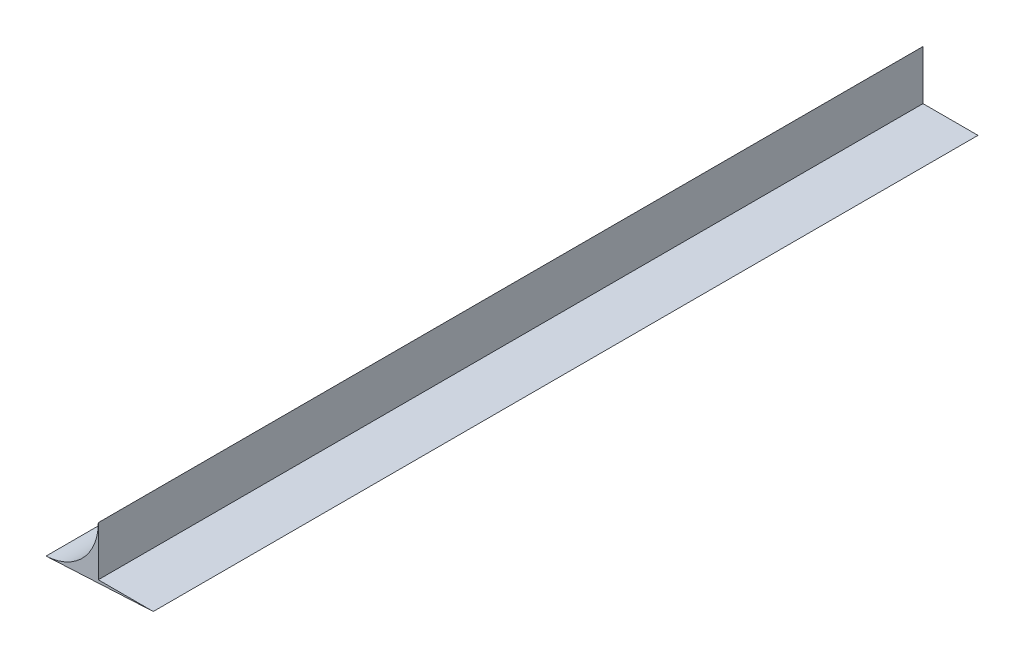
ISO-10303-21;
HEADER;
FILE_DESCRIPTION(('STEP AP214'),'2;1');
FILE_NAME('part.step','',(''),(''),'','','');
FILE_SCHEMA(('AUTOMOTIVE_DESIGN { 1 0 10303 214 1 1 1 1 }'));
ENDSEC;
DATA;
#1=APPLICATION_CONTEXT('core data for automotive mechanical design processes');
#2=APPLICATION_PROTOCOL_DEFINITION('international standard','automotive_design',2000,#1);
#3=PRODUCT_CONTEXT('',#1,'mechanical');
#4=PRODUCT('Part','Part','',(#3));
#5=PRODUCT_RELATED_PRODUCT_CATEGORY('part','',(#4));
#6=PRODUCT_DEFINITION_FORMATION('','',#4);
#7=PRODUCT_DEFINITION_CONTEXT('part definition',#1,'design');
#8=PRODUCT_DEFINITION('design','',#6,#7);
#9=PRODUCT_DEFINITION_SHAPE('','',#8);
#10=(LENGTH_UNIT() NAMED_UNIT(*) SI_UNIT(.MILLI.,.METRE.));
#11=(NAMED_UNIT(*) PLANE_ANGLE_UNIT() SI_UNIT($,.RADIAN.));
#12=(NAMED_UNIT(*) SI_UNIT($,.STERADIAN.) SOLID_ANGLE_UNIT());
#13=UNCERTAINTY_MEASURE_WITH_UNIT(LENGTH_MEASURE(1.E-05),#10,'distance_accuracy_value','');
#14=(GEOMETRIC_REPRESENTATION_CONTEXT(3) GLOBAL_UNCERTAINTY_ASSIGNED_CONTEXT((#13)) GLOBAL_UNIT_ASSIGNED_CONTEXT((#10,
#11,#12)) REPRESENTATION_CONTEXT('',''));
#15=CARTESIAN_POINT('',(0.,0.,0.));
#16=DIRECTION('',(0.,0.,1.));
#17=DIRECTION('',(1.,0.,0.));
#18=AXIS2_PLACEMENT_3D('',#15,#16,#17);
#19=CARTESIAN_POINT('',(-15.0544258345715,13.5,225.));
#20=DIRECTION('',(0.,0.,-1.));
#21=DIRECTION('',(-1.,0.,0.));
#22=AXIS2_PLACEMENT_3D('',#19,#20,#21);
#23=CYLINDRICAL_SURFACE('',#22,15.0544258345715);
#24=CARTESIAN_POINT('',(-15.0544258345715,13.5,0.));
#25=DIRECTION('',(0.,0.,-1.));
#26=DIRECTION('',(1.,0.,0.));
#27=AXIS2_PLACEMENT_3D('',#24,#25,#26);
#28=CIRCLE('',#27,15.0544258345715);
#29=CARTESIAN_POINT('',(0.,13.5,0.));
#30=VERTEX_POINT('',#29);
#31=CARTESIAN_POINT('',(-14.2665380628308,-1.53379426717536,0.));
#32=VERTEX_POINT('',#31);
#33=EDGE_CURVE('E107',#30,#32,#28,.T.);
#34=ORIENTED_EDGE('',*,*,#33,.T.);
#35=DIRECTION('',(0.,0.,-1.));
#36=VECTOR('',#35,1.);
#37=CARTESIAN_POINT('',(-14.2665380628308,-1.53379426717536,225.));
#38=LINE('',#37,#36);
#39=CARTESIAN_POINT('',(-14.2665380628308,-1.53379426717536,225.));
#40=VERTEX_POINT('',#39);
#41=EDGE_CURVE('E11',#40,#32,#38,.T.);
#42=ORIENTED_EDGE('',*,*,#41,.F.);
#43=CARTESIAN_POINT('',(-15.0544258345715,13.5,225.));
#44=DIRECTION('',(0.,0.,-1.));
#45=DIRECTION('',(1.,0.,0.));
#46=AXIS2_PLACEMENT_3D('',#43,#44,#45);
#47=CIRCLE('',#46,15.0544258345715);
#48=CARTESIAN_POINT('',(0.,13.5,225.));
#49=VERTEX_POINT('',#48);
#50=EDGE_CURVE('E91',#49,#40,#47,.T.);
#51=ORIENTED_EDGE('',*,*,#50,.F.);
#52=DIRECTION('',(0.,0.,-1.));
#53=VECTOR('',#52,1.);
#54=CARTESIAN_POINT('',(0.,13.5,225.));
#55=LINE('',#54,#53);
#56=EDGE_CURVE('E103',#49,#30,#55,.T.);
#57=ORIENTED_EDGE('',*,*,#56,.T.);
#58=EDGE_LOOP('',(#34,#42,#51,#57));
#59=FACE_BOUND('',#58,.T.);
#60=ADVANCED_FACE('F39',(#59),#23,.F.);
#61=CARTESIAN_POINT('',(15.,0.,225.));
#62=DIRECTION('',(-0.0523359562429371,0.998629534754574,0.));
#63=DIRECTION('',(-0.998629534754574,-0.0523359562429371,0.));
#64=AXIS2_PLACEMENT_3D('',#61,#62,#63);
#65=PLANE('',#64);
#66=DIRECTION('',(0.998629534754574,0.0523359562429371,0.));
#67=VECTOR('',#66,1.);
#68=CARTESIAN_POINT('',(15.,0.,0.));
#69=LINE('',#68,#67);
#70=CARTESIAN_POINT('',(15.,0.,0.));
#71=VERTEX_POINT('',#70);
#72=EDGE_CURVE('E96',#32,#71,#69,.T.);
#73=ORIENTED_EDGE('',*,*,#72,.T.);
#74=DIRECTION('',(0.,0.,-1.));
#75=VECTOR('',#74,1.);
#76=CARTESIAN_POINT('',(15.,0.,225.));
#77=LINE('',#76,#75);
#78=CARTESIAN_POINT('',(15.,0.,225.));
#79=VERTEX_POINT('',#78);
#80=EDGE_CURVE('E48',#79,#71,#77,.T.);
#81=ORIENTED_EDGE('',*,*,#80,.F.);
#82=DIRECTION('',(0.998629534754574,0.0523359562429371,0.));
#83=VECTOR('',#82,1.);
#84=CARTESIAN_POINT('',(15.,0.,225.));
#85=LINE('',#84,#83);
#86=EDGE_CURVE('E86',#40,#79,#85,.T.);
#87=ORIENTED_EDGE('',*,*,#86,.F.);
#88=ORIENTED_EDGE('',*,*,#41,.T.);
#89=EDGE_LOOP('',(#73,#81,#87,#88));
#90=FACE_BOUND('',#89,.T.);
#91=ADVANCED_FACE('F95',(#90),#65,.F.);
#92=CARTESIAN_POINT('',(0.,0.,225.));
#93=DIRECTION('',(0.,-1.,0.));
#94=DIRECTION('',(0.,0.,-1.));
#95=AXIS2_PLACEMENT_3D('',#92,#93,#94);
#96=PLANE('',#95);
#97=DIRECTION('',(-1.,0.,0.));
#98=VECTOR('',#97,1.);
#99=CARTESIAN_POINT('',(0.,0.,0.));
#100=LINE('',#99,#98);
#101=CARTESIAN_POINT('',(0.,0.,0.));
#102=VERTEX_POINT('',#101);
#103=EDGE_CURVE('E73',#71,#102,#100,.T.);
#104=ORIENTED_EDGE('',*,*,#103,.T.);
#105=DIRECTION('',(0.,0.,-1.));
#106=VECTOR('',#105,1.);
#107=CARTESIAN_POINT('',(0.,0.,225.));
#108=LINE('',#107,#106);
#109=CARTESIAN_POINT('',(0.,0.,225.));
#110=VERTEX_POINT('',#109);
#111=EDGE_CURVE('E98',#110,#102,#108,.T.);
#112=ORIENTED_EDGE('',*,*,#111,.F.);
#113=DIRECTION('',(-1.,0.,0.));
#114=VECTOR('',#113,1.);
#115=CARTESIAN_POINT('',(0.,0.,225.));
#116=LINE('',#115,#114);
#117=EDGE_CURVE('E89',#79,#110,#116,.T.);
#118=ORIENTED_EDGE('',*,*,#117,.F.);
#119=ORIENTED_EDGE('',*,*,#80,.T.);
#120=EDGE_LOOP('',(#104,#112,#118,#119));
#121=FACE_BOUND('',#120,.T.);
#122=ADVANCED_FACE('F99',(#121),#96,.F.);
#123=CARTESIAN_POINT('',(0.,0.,225.));
#124=DIRECTION('',(-1.,0.,0.));
#125=DIRECTION('',(0.,0.,1.));
#126=AXIS2_PLACEMENT_3D('',#123,#124,#125);
#127=PLANE('',#126);
#128=DIRECTION('',(0.,1.,0.));
#129=VECTOR('',#128,1.);
#130=CARTESIAN_POINT('',(0.,0.,0.));
#131=LINE('',#130,#129);
#132=EDGE_CURVE('E79',#102,#30,#131,.T.);
#133=ORIENTED_EDGE('',*,*,#132,.T.);
#134=ORIENTED_EDGE('',*,*,#56,.F.);
#135=DIRECTION('',(0.,1.,0.));
#136=VECTOR('',#135,1.);
#137=CARTESIAN_POINT('',(0.,0.,225.));
#138=LINE('',#137,#136);
#139=EDGE_CURVE('E56',#110,#49,#138,.T.);
#140=ORIENTED_EDGE('',*,*,#139,.F.);
#141=ORIENTED_EDGE('',*,*,#111,.T.);
#142=EDGE_LOOP('',(#133,#134,#140,#141));
#143=FACE_BOUND('',#142,.T.);
#144=ADVANCED_FACE('F120',(#143),#127,.F.);
#145=CARTESIAN_POINT('',(-15.0544258345715,13.5,225.));
#146=DIRECTION('',(0.,0.,1.));
#147=DIRECTION('',(1.,0.,0.));
#148=AXIS2_PLACEMENT_3D('',#145,#146,#147);
#149=PLANE('',#148);
#150=ORIENTED_EDGE('',*,*,#50,.T.);
#151=ORIENTED_EDGE('',*,*,#86,.T.);
#152=ORIENTED_EDGE('',*,*,#117,.T.);
#153=ORIENTED_EDGE('',*,*,#139,.T.);
#154=EDGE_LOOP('',(#150,#151,#152,#153));
#155=FACE_BOUND('',#154,.T.);
#156=ADVANCED_FACE('F87',(#155),#149,.T.);
#157=CARTESIAN_POINT('',(-15.0544258345715,13.5,0.));
#158=DIRECTION('',(0.,0.,1.));
#159=DIRECTION('',(1.,0.,0.));
#160=AXIS2_PLACEMENT_3D('',#157,#158,#159);
#161=PLANE('',#160);
#162=ORIENTED_EDGE('',*,*,#33,.F.);
#163=ORIENTED_EDGE('',*,*,#132,.F.);
#164=ORIENTED_EDGE('',*,*,#103,.F.);
#165=ORIENTED_EDGE('',*,*,#72,.F.);
#166=EDGE_LOOP('',(#162,#163,#164,#165));
#167=FACE_BOUND('',#166,.T.);
#168=ADVANCED_FACE('F123',(#167),#161,.F.);
#169=CLOSED_SHELL('',(#60,#91,#122,#144,#156,#168));
#170=MANIFOLD_SOLID_BREP('B2',#169);
#171=ADVANCED_BREP_SHAPE_REPRESENTATION('',(#18,#170),#14);
#172=SHAPE_DEFINITION_REPRESENTATION(#9,#171);
ENDSEC;
END-ISO-10303-21;
